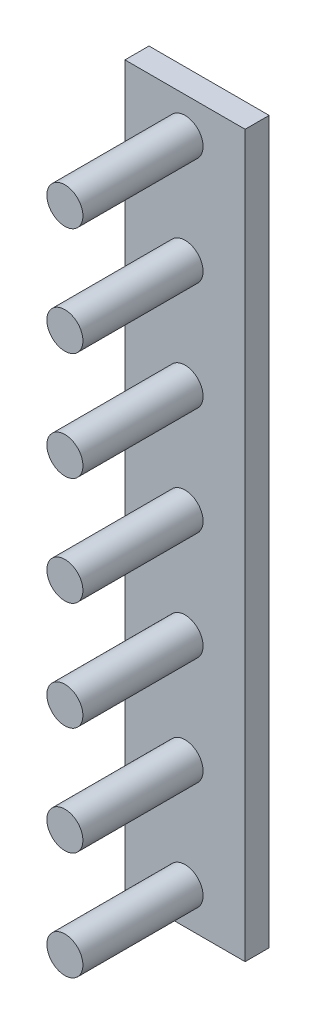
ISO-10303-21;
HEADER;
FILE_DESCRIPTION(('STEP AP214'),'2;1');
FILE_NAME('part.step','',(''),(''),'','','');
FILE_SCHEMA(('AUTOMOTIVE_DESIGN { 1 0 10303 214 1 1 1 1 }'));
ENDSEC;
DATA;
#1=APPLICATION_CONTEXT('core data for automotive mechanical design processes');
#2=APPLICATION_PROTOCOL_DEFINITION('international standard','automotive_design',2000,#1);
#3=PRODUCT_CONTEXT('',#1,'mechanical');
#4=PRODUCT('Part','Part','',(#3));
#5=PRODUCT_RELATED_PRODUCT_CATEGORY('part','',(#4));
#6=PRODUCT_DEFINITION_FORMATION('','',#4);
#7=PRODUCT_DEFINITION_CONTEXT('part definition',#1,'design');
#8=PRODUCT_DEFINITION('design','',#6,#7);
#9=PRODUCT_DEFINITION_SHAPE('','',#8);
#10=(LENGTH_UNIT() NAMED_UNIT(*) SI_UNIT(.MILLI.,.METRE.));
#11=(NAMED_UNIT(*) PLANE_ANGLE_UNIT() SI_UNIT($,.RADIAN.));
#12=(NAMED_UNIT(*) SI_UNIT($,.STERADIAN.) SOLID_ANGLE_UNIT());
#13=UNCERTAINTY_MEASURE_WITH_UNIT(LENGTH_MEASURE(1.E-05),#10,'distance_accuracy_value','');
#14=(GEOMETRIC_REPRESENTATION_CONTEXT(3) GLOBAL_UNCERTAINTY_ASSIGNED_CONTEXT((#13)) GLOBAL_UNIT_ASSIGNED_CONTEXT((#10,
#11,#12)) REPRESENTATION_CONTEXT('',''));
#15=CARTESIAN_POINT('',(0.,0.,0.));
#16=DIRECTION('',(0.,0.,1.));
#17=DIRECTION('',(1.,0.,0.));
#18=AXIS2_PLACEMENT_3D('',#15,#16,#17);
#19=CARTESIAN_POINT('',(49.9999999999989,300.,20.));
#20=DIRECTION('',(0.,-1.,0.));
#21=DIRECTION('',(1.,0.,0.));
#22=AXIS2_PLACEMENT_3D('',#19,#20,#21);
#23=PLANE('',#22);
#24=DIRECTION('',(-1.,0.,0.));
#25=VECTOR('',#24,1.);
#26=CARTESIAN_POINT('',(49.9999999999989,300.,0.));
#27=LINE('',#26,#25);
#28=CARTESIAN_POINT('',(49.9999999999989,300.,0.));
#29=VERTEX_POINT('',#28);
#30=CARTESIAN_POINT('',(-50.0000000000011,300.,0.));
#31=VERTEX_POINT('',#30);
#32=EDGE_CURVE('E111',#29,#31,#27,.T.);
#33=ORIENTED_EDGE('',*,*,#32,.T.);
#34=DIRECTION('',(0.,0.,-1.));
#35=VECTOR('',#34,1.);
#36=CARTESIAN_POINT('',(-50.0000000000011,300.,20.));
#37=LINE('',#36,#35);
#38=CARTESIAN_POINT('',(-50.0000000000011,300.,20.));
#39=VERTEX_POINT('',#38);
#40=EDGE_CURVE('E100',#39,#31,#37,.T.);
#41=ORIENTED_EDGE('',*,*,#40,.F.);
#42=DIRECTION('',(-1.,0.,0.));
#43=VECTOR('',#42,1.);
#44=CARTESIAN_POINT('',(49.9999999999989,300.,20.));
#45=LINE('',#44,#43);
#46=CARTESIAN_POINT('',(49.9999999999989,300.,20.));
#47=VERTEX_POINT('',#46);
#48=EDGE_CURVE('E92',#47,#39,#45,.T.);
#49=ORIENTED_EDGE('',*,*,#48,.F.);
#50=DIRECTION('',(0.,0.,-1.));
#51=VECTOR('',#50,1.);
#52=CARTESIAN_POINT('',(49.9999999999989,300.,20.));
#53=LINE('',#52,#51);
#54=EDGE_CURVE('E107',#47,#29,#53,.T.);
#55=ORIENTED_EDGE('',*,*,#54,.T.);
#56=EDGE_LOOP('',(#33,#41,#49,#55));
#57=FACE_BOUND('',#56,.T.);
#58=ADVANCED_FACE('F39',(#57),#23,.F.);
#59=CARTESIAN_POINT('',(-49.999999999999,-300.,20.));
#60=DIRECTION('',(1.,0.,0.));
#61=DIRECTION('',(0.,1.,0.));
#62=AXIS2_PLACEMENT_3D('',#59,#60,#61);
#63=PLANE('',#62);
#64=DIRECTION('',(0.,-1.,0.));
#65=VECTOR('',#64,1.);
#66=CARTESIAN_POINT('',(-49.999999999999,-300.,0.));
#67=LINE('',#66,#65);
#68=CARTESIAN_POINT('',(-49.999999999999,-300.,0.));
#69=VERTEX_POINT('',#68);
#70=EDGE_CURVE('E98',#31,#69,#67,.T.);
#71=ORIENTED_EDGE('',*,*,#70,.T.);
#72=DIRECTION('',(0.,0.,-1.));
#73=VECTOR('',#72,1.);
#74=CARTESIAN_POINT('',(-49.999999999999,-300.,20.));
#75=LINE('',#74,#73);
#76=CARTESIAN_POINT('',(-49.999999999999,-300.,20.));
#77=VERTEX_POINT('',#76);
#78=EDGE_CURVE('E96',#77,#69,#75,.T.);
#79=ORIENTED_EDGE('',*,*,#78,.F.);
#80=DIRECTION('',(0.,-1.,0.));
#81=VECTOR('',#80,1.);
#82=CARTESIAN_POINT('',(-49.999999999999,-300.,20.));
#83=LINE('',#82,#81);
#84=EDGE_CURVE('E87',#39,#77,#83,.T.);
#85=ORIENTED_EDGE('',*,*,#84,.F.);
#86=ORIENTED_EDGE('',*,*,#40,.T.);
#87=EDGE_LOOP('',(#71,#79,#85,#86));
#88=FACE_BOUND('',#87,.T.);
#89=ADVANCED_FACE('F97',(#88),#63,.F.);
#90=CARTESIAN_POINT('',(50.000000000001,-300.,20.));
#91=DIRECTION('',(0.,1.,0.));
#92=DIRECTION('',(-1.,0.,0.));
#93=AXIS2_PLACEMENT_3D('',#90,#91,#92);
#94=PLANE('',#93);
#95=DIRECTION('',(1.,0.,0.));
#96=VECTOR('',#95,1.);
#97=CARTESIAN_POINT('',(50.000000000001,-300.,0.));
#98=LINE('',#97,#96);
#99=CARTESIAN_POINT('',(50.000000000001,-300.,0.));
#100=VERTEX_POINT('',#99);
#101=EDGE_CURVE('E73',#69,#100,#98,.T.);
#102=ORIENTED_EDGE('',*,*,#101,.T.);
#103=DIRECTION('',(0.,0.,-1.));
#104=VECTOR('',#103,1.);
#105=CARTESIAN_POINT('',(50.000000000001,-300.,20.));
#106=LINE('',#105,#104);
#107=CARTESIAN_POINT('',(50.000000000001,-300.,20.));
#108=VERTEX_POINT('',#107);
#109=EDGE_CURVE('E101',#108,#100,#106,.T.);
#110=ORIENTED_EDGE('',*,*,#109,.F.);
#111=DIRECTION('',(1.,0.,0.));
#112=VECTOR('',#111,1.);
#113=CARTESIAN_POINT('',(50.000000000001,-300.,20.));
#114=LINE('',#113,#112);
#115=EDGE_CURVE('E90',#77,#108,#114,.T.);
#116=ORIENTED_EDGE('',*,*,#115,.F.);
#117=ORIENTED_EDGE('',*,*,#78,.T.);
#118=EDGE_LOOP('',(#102,#110,#116,#117));
#119=FACE_BOUND('',#118,.T.);
#120=ADVANCED_FACE('F103',(#119),#94,.F.);
#121=CARTESIAN_POINT('',(50.000000000001,-300.,20.));
#122=DIRECTION('',(-1.,0.,0.));
#123=DIRECTION('',(0.,-1.,0.));
#124=AXIS2_PLACEMENT_3D('',#121,#122,#123);
#125=PLANE('',#124);
#126=DIRECTION('',(0.,1.,0.));
#127=VECTOR('',#126,1.);
#128=CARTESIAN_POINT('',(50.000000000001,-300.,0.));
#129=LINE('',#128,#127);
#130=EDGE_CURVE('E79',#100,#29,#129,.T.);
#131=ORIENTED_EDGE('',*,*,#130,.T.);
#132=ORIENTED_EDGE('',*,*,#54,.F.);
#133=DIRECTION('',(0.,1.,0.));
#134=VECTOR('',#133,1.);
#135=CARTESIAN_POINT('',(50.000000000001,-300.,20.));
#136=LINE('',#135,#134);
#137=EDGE_CURVE('E56',#108,#47,#136,.T.);
#138=ORIENTED_EDGE('',*,*,#137,.F.);
#139=ORIENTED_EDGE('',*,*,#109,.T.);
#140=EDGE_LOOP('',(#131,#132,#138,#139));
#141=FACE_BOUND('',#140,.T.);
#142=ADVANCED_FACE('F156',(#141),#125,.F.);
#143=CARTESIAN_POINT('',(0.,0.,20.));
#144=DIRECTION('',(0.,0.,-1.));
#145=DIRECTION('',(-1.,0.,0.));
#146=AXIS2_PLACEMENT_3D('',#143,#144,#145);
#147=PLANE('',#146);
#148=CARTESIAN_POINT('',(-2.4980018054066E-13,-270.,20.));
#149=DIRECTION('',(0.,0.,-1.));
#150=DIRECTION('',(-1.,0.,0.));
#151=AXIS2_PLACEMENT_3D('',#148,#149,#150);
#152=CIRCLE('',#151,15.);
#153=CARTESIAN_POINT('',(-15.0000000000003,-270.,20.));
#154=VERTEX_POINT('',#153);
#155=EDGE_CURVE('E11',#154,#154,#152,.F.);
#156=ORIENTED_EDGE('',*,*,#155,.F.);
#157=EDGE_LOOP('',(#156));
#158=FACE_BOUND('',#157,.T.);
#159=CARTESIAN_POINT('',(-1.66533453693773E-13,-180.,20.));
#160=DIRECTION('',(0.,0.,-1.));
#161=DIRECTION('',(-1.,0.,0.));
#162=AXIS2_PLACEMENT_3D('',#159,#160,#161);
#163=CIRCLE('',#162,15.);
#164=CARTESIAN_POINT('',(-15.0000000000002,-180.,20.));
#165=VERTEX_POINT('',#164);
#166=EDGE_CURVE('E48',#165,#165,#163,.F.);
#167=ORIENTED_EDGE('',*,*,#166,.F.);
#168=EDGE_LOOP('',(#167));
#169=FACE_BOUND('',#168,.T.);
#170=CARTESIAN_POINT('',(-4.44089209850063E-13,270.,20.));
#171=DIRECTION('',(0.,0.,-1.));
#172=DIRECTION('',(-1.,0.,0.));
#173=AXIS2_PLACEMENT_3D('',#170,#171,#172);
#174=CIRCLE('',#173,15.);
#175=CARTESIAN_POINT('',(-15.0000000000005,270.,20.));
#176=VERTEX_POINT('',#175);
#177=EDGE_CURVE('E144',#176,#176,#174,.F.);
#178=ORIENTED_EDGE('',*,*,#177,.F.);
#179=EDGE_LOOP('',(#178));
#180=FACE_BOUND('',#179,.T.);
#181=CARTESIAN_POINT('',(-3.05311331771918E-13,180.,20.));
#182=DIRECTION('',(0.,0.,-1.));
#183=DIRECTION('',(-1.,0.,0.));
#184=AXIS2_PLACEMENT_3D('',#181,#182,#183);
#185=CIRCLE('',#184,15.);
#186=CARTESIAN_POINT('',(-15.0000000000003,180.,20.));
#187=VERTEX_POINT('',#186);
#188=EDGE_CURVE('E140',#187,#187,#185,.F.);
#189=ORIENTED_EDGE('',*,*,#188,.F.);
#190=EDGE_LOOP('',(#189));
#191=FACE_BOUND('',#190,.T.);
#192=CARTESIAN_POINT('',(-1.52655665885959E-13,90.,20.));
#193=DIRECTION('',(0.,0.,-1.));
#194=DIRECTION('',(-1.,0.,0.));
#195=AXIS2_PLACEMENT_3D('',#192,#193,#194);
#196=CIRCLE('',#195,15.);
#197=CARTESIAN_POINT('',(-15.0000000000002,90.,20.));
#198=VERTEX_POINT('',#197);
#199=EDGE_CURVE('E136',#198,#198,#196,.F.);
#200=ORIENTED_EDGE('',*,*,#199,.F.);
#201=EDGE_LOOP('',(#200));
#202=FACE_BOUND('',#201,.T.);
#203=CARTESIAN_POINT('',(0.,-90.,20.));
#204=DIRECTION('',(0.,0.,-1.));
#205=DIRECTION('',(-1.,0.,0.));
#206=AXIS2_PLACEMENT_3D('',#203,#204,#205);
#207=CIRCLE('',#206,15.);
#208=CARTESIAN_POINT('',(-15.0000000000001,-90.,20.));
#209=VERTEX_POINT('',#208);
#210=EDGE_CURVE('E132',#209,#209,#207,.F.);
#211=ORIENTED_EDGE('',*,*,#210,.F.);
#212=EDGE_LOOP('',(#211));
#213=FACE_BOUND('',#212,.T.);
#214=CARTESIAN_POINT('',(0.,0.,20.));
#215=DIRECTION('',(0.,0.,-1.));
#216=DIRECTION('',(-1.,0.,0.));
#217=AXIS2_PLACEMENT_3D('',#214,#215,#216);
#218=CIRCLE('',#217,15.);
#219=CARTESIAN_POINT('',(-15.,0.,20.));
#220=VERTEX_POINT('',#219);
#221=EDGE_CURVE('E128',#220,#220,#218,.F.);
#222=ORIENTED_EDGE('',*,*,#221,.F.);
#223=EDGE_LOOP('',(#222));
#224=FACE_BOUND('',#223,.T.);
#225=ORIENTED_EDGE('',*,*,#48,.T.);
#226=ORIENTED_EDGE('',*,*,#84,.T.);
#227=ORIENTED_EDGE('',*,*,#115,.T.);
#228=ORIENTED_EDGE('',*,*,#137,.T.);
#229=EDGE_LOOP('',(#225,#226,#227,#228));
#230=FACE_BOUND('',#229,.T.);
#231=ADVANCED_FACE('F88',(#158,#169,#180,#191,#202,#213,#224,#230),#147,.F.);
#232=CARTESIAN_POINT('',(0.,0.,0.));
#233=DIRECTION('',(0.,0.,-1.));
#234=DIRECTION('',(-1.,0.,0.));
#235=AXIS2_PLACEMENT_3D('',#232,#233,#234);
#236=PLANE('',#235);
#237=ORIENTED_EDGE('',*,*,#32,.F.);
#238=ORIENTED_EDGE('',*,*,#130,.F.);
#239=ORIENTED_EDGE('',*,*,#101,.F.);
#240=ORIENTED_EDGE('',*,*,#70,.F.);
#241=EDGE_LOOP('',(#237,#238,#239,#240));
#242=FACE_BOUND('',#241,.T.);
#243=ADVANCED_FACE('F155',(#242),#236,.T.);
#244=CARTESIAN_POINT('',(0.,0.,120.));
#245=DIRECTION('',(0.,0.,-1.));
#246=DIRECTION('',(-1.,0.,0.));
#247=AXIS2_PLACEMENT_3D('',#244,#245,#246);
#248=CYLINDRICAL_SURFACE('',#247,15.);
#249=CARTESIAN_POINT('',(0.,0.,120.));
#250=DIRECTION('',(0.,0.,1.));
#251=DIRECTION('',(1.,0.,0.));
#252=AXIS2_PLACEMENT_3D('',#249,#250,#251);
#253=CIRCLE('',#252,15.);
#254=CARTESIAN_POINT('',(15.,0.,120.));
#255=VERTEX_POINT('',#254);
#256=EDGE_CURVE('E115',#255,#255,#253,.T.);
#257=ORIENTED_EDGE('',*,*,#256,.F.);
#258=EDGE_LOOP('',(#257));
#259=FACE_BOUND('',#258,.T.);
#260=ORIENTED_EDGE('',*,*,#221,.T.);
#261=EDGE_LOOP('',(#260));
#262=FACE_BOUND('',#261,.T.);
#263=ADVANCED_FACE('F169',(#259,#262),#248,.T.);
#264=CARTESIAN_POINT('',(0.,0.,120.));
#265=DIRECTION('',(0.,0.,1.));
#266=DIRECTION('',(1.,0.,0.));
#267=AXIS2_PLACEMENT_3D('',#264,#265,#266);
#268=PLANE('',#267);
#269=ORIENTED_EDGE('',*,*,#256,.T.);
#270=EDGE_LOOP('',(#269));
#271=FACE_BOUND('',#270,.T.);
#272=ADVANCED_FACE('F171',(#271),#268,.T.);
#273=CARTESIAN_POINT('',(0.,-90.,120.));
#274=DIRECTION('',(0.,0.,-1.));
#275=DIRECTION('',(-1.,0.,0.));
#276=AXIS2_PLACEMENT_3D('',#273,#274,#275);
#277=CYLINDRICAL_SURFACE('',#276,15.);
#278=CARTESIAN_POINT('',(0.,-90.,120.));
#279=DIRECTION('',(0.,0.,1.));
#280=DIRECTION('',(-1.,0.,0.));
#281=AXIS2_PLACEMENT_3D('',#278,#279,#280);
#282=CIRCLE('',#281,15.);
#283=CARTESIAN_POINT('',(-15.0000000000001,-90.,120.));
#284=VERTEX_POINT('',#283);
#285=EDGE_CURVE('E376',#284,#284,#282,.T.);
#286=ORIENTED_EDGE('',*,*,#285,.F.);
#287=EDGE_LOOP('',(#286));
#288=FACE_BOUND('',#287,.T.);
#289=ORIENTED_EDGE('',*,*,#210,.T.);
#290=EDGE_LOOP('',(#289));
#291=FACE_BOUND('',#290,.T.);
#292=ADVANCED_FACE('F178',(#288,#291),#277,.T.);
#293=CARTESIAN_POINT('',(0.,-90.,120.));
#294=DIRECTION('',(0.,0.,-1.));
#295=DIRECTION('',(-1.,0.,0.));
#296=AXIS2_PLACEMENT_3D('',#293,#294,#295);
#297=PLANE('',#296);
#298=ORIENTED_EDGE('',*,*,#285,.T.);
#299=EDGE_LOOP('',(#298));
#300=FACE_BOUND('',#299,.T.);
#301=ADVANCED_FACE('F241',(#300),#297,.F.);
#302=CARTESIAN_POINT('',(-1.52655665885959E-13,90.,120.));
#303=DIRECTION('',(0.,0.,-1.));
#304=DIRECTION('',(-1.,0.,0.));
#305=AXIS2_PLACEMENT_3D('',#302,#303,#304);
#306=CYLINDRICAL_SURFACE('',#305,15.);
#307=CARTESIAN_POINT('',(-1.52655665885959E-13,90.,120.));
#308=DIRECTION('',(0.,0.,1.));
#309=DIRECTION('',(1.,0.,0.));
#310=AXIS2_PLACEMENT_3D('',#307,#308,#309);
#311=CIRCLE('',#310,15.);
#312=CARTESIAN_POINT('',(14.9999999999998,90.,120.));
#313=VERTEX_POINT('',#312);
#314=EDGE_CURVE('E372',#313,#313,#311,.T.);
#315=ORIENTED_EDGE('',*,*,#314,.F.);
#316=EDGE_LOOP('',(#315));
#317=FACE_BOUND('',#316,.T.);
#318=ORIENTED_EDGE('',*,*,#199,.T.);
#319=EDGE_LOOP('',(#318));
#320=FACE_BOUND('',#319,.T.);
#321=ADVANCED_FACE('F250',(#317,#320),#306,.T.);
#322=CARTESIAN_POINT('',(-1.52655665885959E-13,90.,120.));
#323=DIRECTION('',(0.,0.,1.));
#324=DIRECTION('',(1.,0.,0.));
#325=AXIS2_PLACEMENT_3D('',#322,#323,#324);
#326=PLANE('',#325);
#327=ORIENTED_EDGE('',*,*,#314,.T.);
#328=EDGE_LOOP('',(#327));
#329=FACE_BOUND('',#328,.T.);
#330=ADVANCED_FACE('F259',(#329),#326,.T.);
#331=CARTESIAN_POINT('',(-3.05311331771918E-13,180.,120.));
#332=DIRECTION('',(0.,0.,-1.));
#333=DIRECTION('',(-1.,0.,0.));
#334=AXIS2_PLACEMENT_3D('',#331,#332,#333);
#335=CYLINDRICAL_SURFACE('',#334,15.);
#336=CARTESIAN_POINT('',(-3.05311331771918E-13,180.,120.));
#337=DIRECTION('',(0.,0.,1.));
#338=DIRECTION('',(1.,0.,0.));
#339=AXIS2_PLACEMENT_3D('',#336,#337,#338);
#340=CIRCLE('',#339,15.);
#341=CARTESIAN_POINT('',(14.9999999999997,180.,120.));
#342=VERTEX_POINT('',#341);
#343=EDGE_CURVE('E368',#342,#342,#340,.T.);
#344=ORIENTED_EDGE('',*,*,#343,.F.);
#345=EDGE_LOOP('',(#344));
#346=FACE_BOUND('',#345,.T.);
#347=ORIENTED_EDGE('',*,*,#188,.T.);
#348=EDGE_LOOP('',(#347));
#349=FACE_BOUND('',#348,.T.);
#350=ADVANCED_FACE('F268',(#346,#349),#335,.T.);
#351=CARTESIAN_POINT('',(-3.05311331771918E-13,180.,120.));
#352=DIRECTION('',(0.,0.,1.));
#353=DIRECTION('',(1.,0.,0.));
#354=AXIS2_PLACEMENT_3D('',#351,#352,#353);
#355=PLANE('',#354);
#356=ORIENTED_EDGE('',*,*,#343,.T.);
#357=EDGE_LOOP('',(#356));
#358=FACE_BOUND('',#357,.T.);
#359=ADVANCED_FACE('F277',(#358),#355,.T.);
#360=CARTESIAN_POINT('',(-4.44089209850063E-13,270.,120.));
#361=DIRECTION('',(0.,0.,-1.));
#362=DIRECTION('',(-1.,0.,0.));
#363=AXIS2_PLACEMENT_3D('',#360,#361,#362);
#364=CYLINDRICAL_SURFACE('',#363,15.);
#365=CARTESIAN_POINT('',(-4.44089209850063E-13,270.,120.));
#366=DIRECTION('',(0.,0.,1.));
#367=DIRECTION('',(1.,0.,0.));
#368=AXIS2_PLACEMENT_3D('',#365,#366,#367);
#369=CIRCLE('',#368,15.);
#370=CARTESIAN_POINT('',(14.9999999999996,270.,120.));
#371=VERTEX_POINT('',#370);
#372=EDGE_CURVE('E362',#371,#371,#369,.T.);
#373=ORIENTED_EDGE('',*,*,#372,.F.);
#374=EDGE_LOOP('',(#373));
#375=FACE_BOUND('',#374,.T.);
#376=ORIENTED_EDGE('',*,*,#177,.T.);
#377=EDGE_LOOP('',(#376));
#378=FACE_BOUND('',#377,.T.);
#379=ADVANCED_FACE('F286',(#375,#378),#364,.T.);
#380=CARTESIAN_POINT('',(-4.44089209850063E-13,270.,120.));
#381=DIRECTION('',(0.,0.,1.));
#382=DIRECTION('',(1.,0.,0.));
#383=AXIS2_PLACEMENT_3D('',#380,#381,#382);
#384=PLANE('',#383);
#385=ORIENTED_EDGE('',*,*,#372,.T.);
#386=EDGE_LOOP('',(#385));
#387=FACE_BOUND('',#386,.T.);
#388=ADVANCED_FACE('F295',(#387),#384,.T.);
#389=CARTESIAN_POINT('',(-1.66533453693773E-13,-180.,120.));
#390=DIRECTION('',(0.,0.,-1.));
#391=DIRECTION('',(-1.,0.,0.));
#392=AXIS2_PLACEMENT_3D('',#389,#390,#391);
#393=CYLINDRICAL_SURFACE('',#392,15.);
#394=CARTESIAN_POINT('',(-1.66533453693773E-13,-180.,120.));
#395=DIRECTION('',(0.,0.,1.));
#396=DIRECTION('',(-1.,0.,0.));
#397=AXIS2_PLACEMENT_3D('',#394,#395,#396);
#398=CIRCLE('',#397,15.);
#399=CARTESIAN_POINT('',(-15.0000000000002,-180.,120.));
#400=VERTEX_POINT('',#399);
#401=EDGE_CURVE('E358',#400,#400,#398,.T.);
#402=ORIENTED_EDGE('',*,*,#401,.F.);
#403=EDGE_LOOP('',(#402));
#404=FACE_BOUND('',#403,.T.);
#405=ORIENTED_EDGE('',*,*,#166,.T.);
#406=EDGE_LOOP('',(#405));
#407=FACE_BOUND('',#406,.T.);
#408=ADVANCED_FACE('F151',(#404,#407),#393,.T.);
#409=CARTESIAN_POINT('',(-1.66533453693773E-13,-180.,120.));
#410=DIRECTION('',(0.,0.,-1.));
#411=DIRECTION('',(-1.,0.,0.));
#412=AXIS2_PLACEMENT_3D('',#409,#410,#411);
#413=PLANE('',#412);
#414=ORIENTED_EDGE('',*,*,#401,.T.);
#415=EDGE_LOOP('',(#414));
#416=FACE_BOUND('',#415,.T.);
#417=ADVANCED_FACE('F312',(#416),#413,.F.);
#418=CARTESIAN_POINT('',(-2.4980018054066E-13,-270.,120.));
#419=DIRECTION('',(0.,0.,-1.));
#420=DIRECTION('',(-1.,0.,0.));
#421=AXIS2_PLACEMENT_3D('',#418,#419,#420);
#422=CYLINDRICAL_SURFACE('',#421,15.);
#423=CARTESIAN_POINT('',(-2.4980018054066E-13,-270.,120.));
#424=DIRECTION('',(0.,0.,1.));
#425=DIRECTION('',(-1.,0.,0.));
#426=AXIS2_PLACEMENT_3D('',#423,#424,#425);
#427=CIRCLE('',#426,15.);
#428=CARTESIAN_POINT('',(-15.0000000000003,-270.,120.));
#429=VERTEX_POINT('',#428);
#430=EDGE_CURVE('E356',#429,#429,#427,.T.);
#431=ORIENTED_EDGE('',*,*,#430,.F.);
#432=EDGE_LOOP('',(#431));
#433=FACE_BOUND('',#432,.T.);
#434=ORIENTED_EDGE('',*,*,#155,.T.);
#435=EDGE_LOOP('',(#434));
#436=FACE_BOUND('',#435,.T.);
#437=ADVANCED_FACE('F321',(#433,#436),#422,.T.);
#438=CARTESIAN_POINT('',(-2.4980018054066E-13,-270.,120.));
#439=DIRECTION('',(0.,0.,-1.));
#440=DIRECTION('',(-1.,0.,0.));
#441=AXIS2_PLACEMENT_3D('',#438,#439,#440);
#442=PLANE('',#441);
#443=ORIENTED_EDGE('',*,*,#430,.T.);
#444=EDGE_LOOP('',(#443));
#445=FACE_BOUND('',#444,.T.);
#446=ADVANCED_FACE('F330',(#445),#442,.F.);
#447=CLOSED_SHELL('',(#58,#89,#120,#142,#231,#243,#263,#272,#292,#301,#321,#330,#350,#359,#379,
#388,#408,#417,#437,#446));
#448=MANIFOLD_SOLID_BREP('B2',#447);
#449=ADVANCED_BREP_SHAPE_REPRESENTATION('',(#18,#448),#14);
#450=SHAPE_DEFINITION_REPRESENTATION(#9,#449);
ENDSEC;
END-ISO-10303-21;
